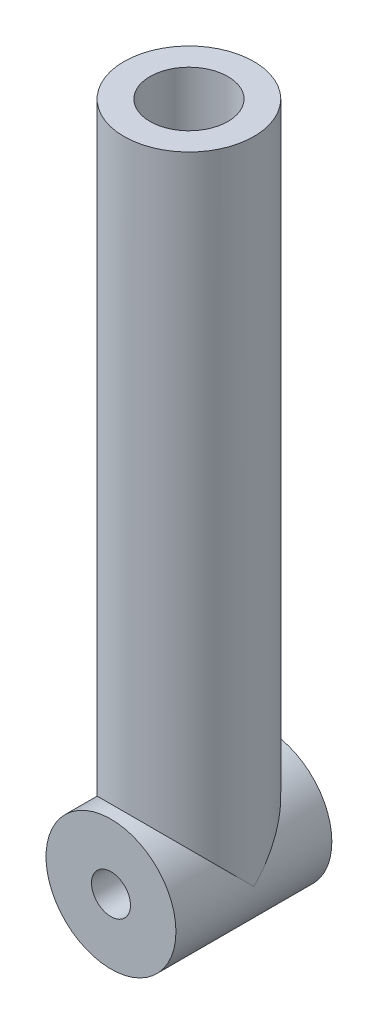
ISO-10303-21;
HEADER;
FILE_DESCRIPTION(('STEP AP214'),'2;1');
FILE_NAME('part.step','',(''),(''),'','','');
FILE_SCHEMA(('AUTOMOTIVE_DESIGN { 1 0 10303 214 1 1 1 1 }'));
ENDSEC;
DATA;
#1=APPLICATION_CONTEXT('core data for automotive mechanical design processes');
#2=APPLICATION_PROTOCOL_DEFINITION('international standard','automotive_design',2000,#1);
#3=PRODUCT_CONTEXT('',#1,'mechanical');
#4=PRODUCT('Part','Part','',(#3));
#5=PRODUCT_RELATED_PRODUCT_CATEGORY('part','',(#4));
#6=PRODUCT_DEFINITION_FORMATION('','',#4);
#7=PRODUCT_DEFINITION_CONTEXT('part definition',#1,'design');
#8=PRODUCT_DEFINITION('design','',#6,#7);
#9=PRODUCT_DEFINITION_SHAPE('','',#8);
#10=(LENGTH_UNIT() NAMED_UNIT(*) SI_UNIT(.MILLI.,.METRE.));
#11=(NAMED_UNIT(*) PLANE_ANGLE_UNIT() SI_UNIT($,.RADIAN.));
#12=(NAMED_UNIT(*) SI_UNIT($,.STERADIAN.) SOLID_ANGLE_UNIT());
#13=UNCERTAINTY_MEASURE_WITH_UNIT(LENGTH_MEASURE(1.E-05),#10,'distance_accuracy_value','');
#14=(GEOMETRIC_REPRESENTATION_CONTEXT(3) GLOBAL_UNCERTAINTY_ASSIGNED_CONTEXT((#13)) GLOBAL_UNIT_ASSIGNED_CONTEXT((#10,
#11,#12)) REPRESENTATION_CONTEXT('',''));
#15=CARTESIAN_POINT('',(0.,0.,0.));
#16=DIRECTION('',(0.,0.,1.));
#17=DIRECTION('',(1.,0.,0.));
#18=AXIS2_PLACEMENT_3D('',#15,#16,#17);
#19=CARTESIAN_POINT('',(0.,250.,0.));
#20=DIRECTION('',(0.,-1.,0.));
#21=DIRECTION('',(0.,0.,-1.));
#22=AXIS2_PLACEMENT_3D('',#19,#20,#21);
#23=CYLINDRICAL_SURFACE('',#22,25.);
#24=CARTESIAN_POINT('',(0.,250.,0.));
#25=DIRECTION('',(0.,1.,0.));
#26=DIRECTION('',(0.,0.,1.));
#27=AXIS2_PLACEMENT_3D('',#24,#25,#26);
#28=CIRCLE('',#27,25.);
#29=CARTESIAN_POINT('',(0.,250.,25.));
#30=VERTEX_POINT('',#29);
#31=EDGE_CURVE('E11',#30,#30,#28,.T.);
#32=ORIENTED_EDGE('',*,*,#31,.F.);
#33=EDGE_LOOP('',(#32));
#34=FACE_BOUND('',#33,.T.);
#35=CARTESIAN_POINT('',(0.,0.,0.));
#36=DIRECTION('',(0.,-0.707106781186548,-0.707106781186548));
#37=DIRECTION('',(0.,-0.707106781186548,0.707106781186548));
#38=AXIS2_PLACEMENT_3D('',#35,#36,#37);
#39=ELLIPSE('',#38,35.3553390593274,25.);
#40=CARTESIAN_POINT('',(-25.,0.,0.));
#41=VERTEX_POINT('',#40);
#42=CARTESIAN_POINT('',(25.,0.,0.));
#43=VERTEX_POINT('',#42);
#44=EDGE_CURVE('E26',#41,#43,#39,.T.);
#45=ORIENTED_EDGE('',*,*,#44,.F.);
#46=CARTESIAN_POINT('',(0.,0.,0.));
#47=DIRECTION('',(0.,-0.707106781186548,0.707106781186548));
#48=DIRECTION('',(0.,-0.707106781186548,-0.707106781186548));
#49=AXIS2_PLACEMENT_3D('',#46,#47,#48);
#50=ELLIPSE('',#49,35.3553390593274,25.);
#51=EDGE_CURVE('E32',#43,#41,#50,.T.);
#52=ORIENTED_EDGE('',*,*,#51,.F.);
#53=EDGE_LOOP('',(#45,#52));
#54=FACE_BOUND('',#53,.T.);
#55=ADVANCED_FACE('F19',(#34,#54),#23,.T.);
#56=CARTESIAN_POINT('',(0.,250.,0.));
#57=DIRECTION('',(0.,1.,0.));
#58=DIRECTION('',(0.,0.,1.));
#59=AXIS2_PLACEMENT_3D('',#56,#57,#58);
#60=PLANE('',#59);
#61=CARTESIAN_POINT('',(0.,250.,0.));
#62=DIRECTION('',(0.,1.,0.));
#63=DIRECTION('',(0.,0.,1.));
#64=AXIS2_PLACEMENT_3D('',#61,#62,#63);
#65=CIRCLE('',#64,15.);
#66=CARTESIAN_POINT('',(0.,250.,15.));
#67=VERTEX_POINT('',#66);
#68=EDGE_CURVE('E51',#67,#67,#65,.T.);
#69=ORIENTED_EDGE('',*,*,#68,.F.);
#70=EDGE_LOOP('',(#69));
#71=FACE_BOUND('',#70,.T.);
#72=ORIENTED_EDGE('',*,*,#31,.T.);
#73=EDGE_LOOP('',(#72));
#74=FACE_BOUND('',#73,.T.);
#75=ADVANCED_FACE('F66',(#71,#74),#60,.T.);
#76=CARTESIAN_POINT('',(0.,0.,30.));
#77=DIRECTION('',(0.,0.,-1.));
#78=DIRECTION('',(-1.,0.,0.));
#79=AXIS2_PLACEMENT_3D('',#76,#77,#78);
#80=CYLINDRICAL_SURFACE('',#79,25.);
#81=CARTESIAN_POINT('',(0.,0.,-30.));
#82=DIRECTION('',(0.,0.,1.));
#83=DIRECTION('',(1.,0.,0.));
#84=AXIS2_PLACEMENT_3D('',#81,#82,#83);
#85=CIRCLE('',#84,25.);
#86=CARTESIAN_POINT('',(25.,0.,-30.));
#87=VERTEX_POINT('',#86);
#88=EDGE_CURVE('E39',#87,#87,#85,.T.);
#89=ORIENTED_EDGE('',*,*,#88,.T.);
#90=EDGE_LOOP('',(#89));
#91=FACE_BOUND('',#90,.T.);
#92=CARTESIAN_POINT('',(0.,0.,30.));
#93=DIRECTION('',(0.,0.,1.));
#94=DIRECTION('',(1.,0.,0.));
#95=AXIS2_PLACEMENT_3D('',#92,#93,#94);
#96=CIRCLE('',#95,25.);
#97=CARTESIAN_POINT('',(25.,0.,30.));
#98=VERTEX_POINT('',#97);
#99=EDGE_CURVE('E36',#98,#98,#96,.T.);
#100=ORIENTED_EDGE('',*,*,#99,.F.);
#101=EDGE_LOOP('',(#100));
#102=FACE_BOUND('',#101,.T.);
#103=ORIENTED_EDGE('',*,*,#51,.T.);
#104=ORIENTED_EDGE('',*,*,#44,.T.);
#105=EDGE_LOOP('',(#103,#104));
#106=FACE_BOUND('',#105,.T.);
#107=ADVANCED_FACE('F35',(#91,#102,#106),#80,.T.);
#108=CARTESIAN_POINT('',(0.,0.,30.));
#109=DIRECTION('',(0.,0.,1.));
#110=DIRECTION('',(1.,0.,0.));
#111=AXIS2_PLACEMENT_3D('',#108,#109,#110);
#112=PLANE('',#111);
#113=CARTESIAN_POINT('',(0.,0.,30.));
#114=DIRECTION('',(0.,0.,1.));
#115=DIRECTION('',(1.,0.,0.));
#116=AXIS2_PLACEMENT_3D('',#113,#114,#115);
#117=CIRCLE('',#116,7.5);
#118=CARTESIAN_POINT('',(7.5,0.,30.));
#119=VERTEX_POINT('',#118);
#120=EDGE_CURVE('E45',#119,#119,#117,.T.);
#121=ORIENTED_EDGE('',*,*,#120,.F.);
#122=EDGE_LOOP('',(#121));
#123=FACE_BOUND('',#122,.T.);
#124=ORIENTED_EDGE('',*,*,#99,.T.);
#125=EDGE_LOOP('',(#124));
#126=FACE_BOUND('',#125,.T.);
#127=ADVANCED_FACE('F92',(#123,#126),#112,.T.);
#128=CARTESIAN_POINT('',(0.,0.,-30.));
#129=DIRECTION('',(0.,0.,1.));
#130=DIRECTION('',(1.,0.,0.));
#131=AXIS2_PLACEMENT_3D('',#128,#129,#130);
#132=PLANE('',#131);
#133=CARTESIAN_POINT('',(0.,0.,-30.));
#134=DIRECTION('',(0.,0.,1.));
#135=DIRECTION('',(1.,0.,0.));
#136=AXIS2_PLACEMENT_3D('',#133,#134,#135);
#137=CIRCLE('',#136,7.5);
#138=CARTESIAN_POINT('',(7.5,0.,-30.));
#139=VERTEX_POINT('',#138);
#140=EDGE_CURVE('E43',#139,#139,#137,.T.);
#141=ORIENTED_EDGE('',*,*,#140,.T.);
#142=EDGE_LOOP('',(#141));
#143=FACE_BOUND('',#142,.T.);
#144=ORIENTED_EDGE('',*,*,#88,.F.);
#145=EDGE_LOOP('',(#144));
#146=FACE_BOUND('',#145,.T.);
#147=ADVANCED_FACE('F101',(#143,#146),#132,.F.);
#148=CARTESIAN_POINT('',(0.,0.,-30.));
#149=DIRECTION('',(0.,0.,1.));
#150=DIRECTION('',(1.,0.,0.));
#151=AXIS2_PLACEMENT_3D('',#148,#149,#150);
#152=CYLINDRICAL_SURFACE('',#151,7.5);
#153=ORIENTED_EDGE('',*,*,#140,.F.);
#154=EDGE_LOOP('',(#153));
#155=FACE_BOUND('',#154,.T.);
#156=ORIENTED_EDGE('',*,*,#120,.T.);
#157=EDGE_LOOP('',(#156));
#158=FACE_BOUND('',#157,.T.);
#159=ADVANCED_FACE('F62',(#155,#158),#152,.F.);
#160=CARTESIAN_POINT('',(0.,50.,0.));
#161=DIRECTION('',(0.,1.,0.));
#162=DIRECTION('',(0.,0.,1.));
#163=AXIS2_PLACEMENT_3D('',#160,#161,#162);
#164=CYLINDRICAL_SURFACE('',#163,15.);
#165=CARTESIAN_POINT('',(0.,50.,0.));
#166=DIRECTION('',(0.,1.,0.));
#167=DIRECTION('',(0.,0.,1.));
#168=AXIS2_PLACEMENT_3D('',#165,#166,#167);
#169=CIRCLE('',#168,15.);
#170=CARTESIAN_POINT('',(0.,50.,15.));
#171=VERTEX_POINT('',#170);
#172=EDGE_CURVE('E48',#171,#171,#169,.T.);
#173=ORIENTED_EDGE('',*,*,#172,.F.);
#174=EDGE_LOOP('',(#173));
#175=FACE_BOUND('',#174,.T.);
#176=ORIENTED_EDGE('',*,*,#68,.T.);
#177=EDGE_LOOP('',(#176));
#178=FACE_BOUND('',#177,.T.);
#179=ADVANCED_FACE('F59',(#175,#178),#164,.F.);
#180=CARTESIAN_POINT('',(0.,50.,0.));
#181=DIRECTION('',(0.,1.,0.));
#182=DIRECTION('',(0.,0.,1.));
#183=AXIS2_PLACEMENT_3D('',#180,#181,#182);
#184=PLANE('',#183);
#185=ORIENTED_EDGE('',*,*,#172,.T.);
#186=EDGE_LOOP('',(#185));
#187=FACE_BOUND('',#186,.T.);
#188=ADVANCED_FACE('F57',(#187),#184,.T.);
#189=CLOSED_SHELL('',(#55,#75,#107,#127,#147,#159,#179,#188));
#190=MANIFOLD_SOLID_BREP('B1',#189);
#191=ADVANCED_BREP_SHAPE_REPRESENTATION('',(#18,#190),#14);
#192=SHAPE_DEFINITION_REPRESENTATION(#9,#191);
ENDSEC;
END-ISO-10303-21;
